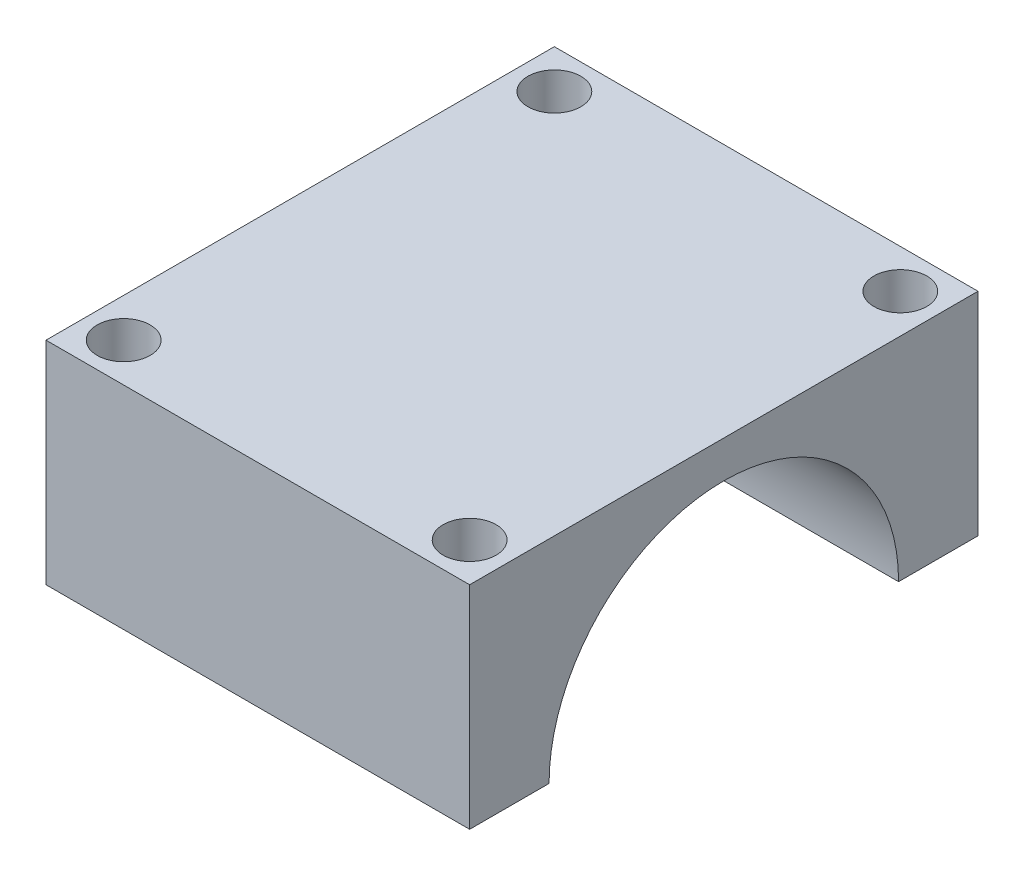
ISO-10303-21;
HEADER;
FILE_DESCRIPTION(('STEP AP214'),'2;1');
FILE_NAME('part.step','',(''),(''),'','','');
FILE_SCHEMA(('AUTOMOTIVE_DESIGN { 1 0 10303 214 1 1 1 1 }'));
ENDSEC;
DATA;
#1=APPLICATION_CONTEXT('core data for automotive mechanical design processes');
#2=APPLICATION_PROTOCOL_DEFINITION('international standard','automotive_design',2000,#1);
#3=PRODUCT_CONTEXT('',#1,'mechanical');
#4=PRODUCT('Part','Part','',(#3));
#5=PRODUCT_RELATED_PRODUCT_CATEGORY('part','',(#4));
#6=PRODUCT_DEFINITION_FORMATION('','',#4);
#7=PRODUCT_DEFINITION_CONTEXT('part definition',#1,'design');
#8=PRODUCT_DEFINITION('design','',#6,#7);
#9=PRODUCT_DEFINITION_SHAPE('','',#8);
#10=(LENGTH_UNIT() NAMED_UNIT(*) SI_UNIT(.MILLI.,.METRE.));
#11=(NAMED_UNIT(*) PLANE_ANGLE_UNIT() SI_UNIT($,.RADIAN.));
#12=(NAMED_UNIT(*) SI_UNIT($,.STERADIAN.) SOLID_ANGLE_UNIT());
#13=UNCERTAINTY_MEASURE_WITH_UNIT(LENGTH_MEASURE(1.E-05),#10,'distance_accuracy_value','');
#14=(GEOMETRIC_REPRESENTATION_CONTEXT(3) GLOBAL_UNCERTAINTY_ASSIGNED_CONTEXT((#13)) GLOBAL_UNIT_ASSIGNED_CONTEXT((#10,
#11,#12)) REPRESENTATION_CONTEXT('',''));
#15=CARTESIAN_POINT('',(0.,0.,0.));
#16=DIRECTION('',(0.,0.,1.));
#17=DIRECTION('',(1.,0.,0.));
#18=AXIS2_PLACEMENT_3D('',#15,#16,#17);
#19=CARTESIAN_POINT('',(15.,30.,18.));
#20=DIRECTION('',(-1.,0.,0.));
#21=DIRECTION('',(0.,0.,1.));
#22=AXIS2_PLACEMENT_3D('',#19,#20,#21);
#23=PLANE('',#22);
#24=DIRECTION('',(0.,-1.,0.));
#25=VECTOR('',#24,1.);
#26=CARTESIAN_POINT('',(15.,30.,18.));
#27=LINE('',#26,#25);
#28=CARTESIAN_POINT('',(15.,30.,18.));
#29=VERTEX_POINT('',#28);
#30=CARTESIAN_POINT('',(15.,15.,18.));
#31=VERTEX_POINT('',#30);
#32=EDGE_CURVE('E124',#29,#31,#27,.T.);
#33=ORIENTED_EDGE('',*,*,#32,.T.);
#34=DIRECTION('',(0.,0.,1.));
#35=VECTOR('',#34,1.);
#36=CARTESIAN_POINT('',(15.,15.,18.));
#37=LINE('',#36,#35);
#38=CARTESIAN_POINT('',(15.,15.,12.375));
#39=VERTEX_POINT('',#38);
#40=EDGE_CURVE('E102',#39,#31,#37,.T.);
#41=ORIENTED_EDGE('',*,*,#40,.F.);
#42=CARTESIAN_POINT('',(15.,15.,0.));
#43=DIRECTION('',(1.,0.,0.));
#44=DIRECTION('',(0.,0.,-1.));
#45=AXIS2_PLACEMENT_3D('',#42,#43,#44);
#46=CIRCLE('',#45,12.375);
#47=CARTESIAN_POINT('',(15.,15.,-12.375));
#48=VERTEX_POINT('',#47);
#49=EDGE_CURVE('E130',#48,#39,#46,.T.);
#50=ORIENTED_EDGE('',*,*,#49,.F.);
#51=CARTESIAN_POINT('',(15.,15.,-18.));
#52=VERTEX_POINT('',#51);
#53=EDGE_CURVE('E71',#52,#48,#37,.T.);
#54=ORIENTED_EDGE('',*,*,#53,.F.);
#55=DIRECTION('',(0.,-1.,0.));
#56=VECTOR('',#55,1.);
#57=CARTESIAN_POINT('',(15.,30.,-18.));
#58=LINE('',#57,#56);
#59=CARTESIAN_POINT('',(15.,30.,-18.));
#60=VERTEX_POINT('',#59);
#61=EDGE_CURVE('E11',#60,#52,#58,.T.);
#62=ORIENTED_EDGE('',*,*,#61,.F.);
#63=DIRECTION('',(0.,0.,-1.));
#64=VECTOR('',#63,1.);
#65=CARTESIAN_POINT('',(15.,30.,18.));
#66=LINE('',#65,#64);
#67=EDGE_CURVE('E129',#29,#60,#66,.T.);
#68=ORIENTED_EDGE('',*,*,#67,.F.);
#69=EDGE_LOOP('',(#33,#41,#50,#54,#62,#68));
#70=FACE_BOUND('',#69,.T.);
#71=ADVANCED_FACE('F47',(#70),#23,.F.);
#72=CARTESIAN_POINT('',(-15.,30.,-18.));
#73=DIRECTION('',(0.,0.,1.));
#74=DIRECTION('',(1.,0.,0.));
#75=AXIS2_PLACEMENT_3D('',#72,#73,#74);
#76=PLANE('',#75);
#77=ORIENTED_EDGE('',*,*,#61,.T.);
#78=DIRECTION('',(1.,0.,0.));
#79=VECTOR('',#78,1.);
#80=CARTESIAN_POINT('',(-15.,15.,-18.));
#81=LINE('',#80,#79);
#82=CARTESIAN_POINT('',(-15.,15.,-18.));
#83=VERTEX_POINT('',#82);
#84=EDGE_CURVE('E107',#83,#52,#81,.T.);
#85=ORIENTED_EDGE('',*,*,#84,.F.);
#86=DIRECTION('',(0.,-1.,0.));
#87=VECTOR('',#86,1.);
#88=CARTESIAN_POINT('',(-15.,30.,-18.));
#89=LINE('',#88,#87);
#90=CARTESIAN_POINT('',(-15.,30.,-18.));
#91=VERTEX_POINT('',#90);
#92=EDGE_CURVE('E55',#91,#83,#89,.T.);
#93=ORIENTED_EDGE('',*,*,#92,.F.);
#94=DIRECTION('',(-1.,0.,0.));
#95=VECTOR('',#94,1.);
#96=CARTESIAN_POINT('',(-15.,30.,-18.));
#97=LINE('',#96,#95);
#98=EDGE_CURVE('E132',#60,#91,#97,.T.);
#99=ORIENTED_EDGE('',*,*,#98,.F.);
#100=EDGE_LOOP('',(#77,#85,#93,#99));
#101=FACE_BOUND('',#100,.T.);
#102=ADVANCED_FACE('F153',(#101),#76,.F.);
#103=CARTESIAN_POINT('',(-15.,30.,18.));
#104=DIRECTION('',(1.,0.,0.));
#105=DIRECTION('',(0.,0.,-1.));
#106=AXIS2_PLACEMENT_3D('',#103,#104,#105);
#107=PLANE('',#106);
#108=ORIENTED_EDGE('',*,*,#92,.T.);
#109=DIRECTION('',(0.,0.,1.));
#110=VECTOR('',#109,1.);
#111=CARTESIAN_POINT('',(-15.,15.,18.));
#112=LINE('',#111,#110);
#113=CARTESIAN_POINT('',(-15.,15.,-12.375));
#114=VERTEX_POINT('',#113);
#115=EDGE_CURVE('E108',#83,#114,#112,.T.);
#116=ORIENTED_EDGE('',*,*,#115,.T.);
#117=CARTESIAN_POINT('',(-15.,15.,0.));
#118=DIRECTION('',(1.,0.,0.));
#119=DIRECTION('',(0.,0.,-1.));
#120=AXIS2_PLACEMENT_3D('',#117,#118,#119);
#121=CIRCLE('',#120,12.375);
#122=CARTESIAN_POINT('',(-15.,15.,12.375));
#123=VERTEX_POINT('',#122);
#124=EDGE_CURVE('E120',#114,#123,#121,.T.);
#125=ORIENTED_EDGE('',*,*,#124,.T.);
#126=CARTESIAN_POINT('',(-15.,15.,18.));
#127=VERTEX_POINT('',#126);
#128=EDGE_CURVE('E63',#123,#127,#112,.T.);
#129=ORIENTED_EDGE('',*,*,#128,.T.);
#130=DIRECTION('',(0.,-1.,0.));
#131=VECTOR('',#130,1.);
#132=CARTESIAN_POINT('',(-15.,30.,18.));
#133=LINE('',#132,#131);
#134=CARTESIAN_POINT('',(-15.,30.,18.));
#135=VERTEX_POINT('',#134);
#136=EDGE_CURVE('E116',#135,#127,#133,.T.);
#137=ORIENTED_EDGE('',*,*,#136,.F.);
#138=DIRECTION('',(0.,0.,1.));
#139=VECTOR('',#138,1.);
#140=CARTESIAN_POINT('',(-15.,30.,18.));
#141=LINE('',#140,#139);
#142=EDGE_CURVE('E145',#91,#135,#141,.T.);
#143=ORIENTED_EDGE('',*,*,#142,.F.);
#144=EDGE_LOOP('',(#108,#116,#125,#129,#137,#143));
#145=FACE_BOUND('',#144,.T.);
#146=ADVANCED_FACE('F114',(#145),#107,.F.);
#147=CARTESIAN_POINT('',(-15.,30.,18.));
#148=DIRECTION('',(0.,0.,-1.));
#149=DIRECTION('',(-1.,0.,0.));
#150=AXIS2_PLACEMENT_3D('',#147,#148,#149);
#151=PLANE('',#150);
#152=ORIENTED_EDGE('',*,*,#136,.T.);
#153=DIRECTION('',(1.,0.,0.));
#154=VECTOR('',#153,1.);
#155=CARTESIAN_POINT('',(-15.,15.,18.));
#156=LINE('',#155,#154);
#157=EDGE_CURVE('E99',#127,#31,#156,.T.);
#158=ORIENTED_EDGE('',*,*,#157,.T.);
#159=ORIENTED_EDGE('',*,*,#32,.F.);
#160=DIRECTION('',(1.,0.,0.));
#161=VECTOR('',#160,1.);
#162=CARTESIAN_POINT('',(-15.,30.,18.));
#163=LINE('',#162,#161);
#164=EDGE_CURVE('E123',#135,#29,#163,.T.);
#165=ORIENTED_EDGE('',*,*,#164,.F.);
#166=EDGE_LOOP('',(#152,#158,#159,#165));
#167=FACE_BOUND('',#166,.T.);
#168=ADVANCED_FACE('F122',(#167),#151,.F.);
#169=CARTESIAN_POINT('',(0.,30.,0.));
#170=DIRECTION('',(0.,-1.,0.));
#171=DIRECTION('',(0.,0.,-1.));
#172=AXIS2_PLACEMENT_3D('',#169,#170,#171);
#173=PLANE('',#172);
#174=CARTESIAN_POINT('',(12.25,30.,-15.25));
#175=DIRECTION('',(0.,1.,0.));
#176=DIRECTION('',(0.,0.,-1.));
#177=AXIS2_PLACEMENT_3D('',#174,#175,#176);
#178=CIRCLE('',#177,1.875);
#179=CARTESIAN_POINT('',(12.25,30.,-17.125));
#180=VERTEX_POINT('',#179);
#181=EDGE_CURVE('E158',#180,#180,#178,.T.);
#182=ORIENTED_EDGE('',*,*,#181,.F.);
#183=EDGE_LOOP('',(#182));
#184=FACE_BOUND('',#183,.T.);
#185=CARTESIAN_POINT('',(12.25,30.,15.25));
#186=DIRECTION('',(0.,1.,0.));
#187=DIRECTION('',(0.,0.,1.));
#188=AXIS2_PLACEMENT_3D('',#185,#186,#187);
#189=CIRCLE('',#188,1.875);
#190=CARTESIAN_POINT('',(12.25,30.,17.125));
#191=VERTEX_POINT('',#190);
#192=EDGE_CURVE('E161',#191,#191,#189,.T.);
#193=ORIENTED_EDGE('',*,*,#192,.F.);
#194=EDGE_LOOP('',(#193));
#195=FACE_BOUND('',#194,.T.);
#196=CARTESIAN_POINT('',(-12.25,30.,15.25));
#197=DIRECTION('',(0.,1.,0.));
#198=DIRECTION('',(0.,0.,-1.));
#199=AXIS2_PLACEMENT_3D('',#196,#197,#198);
#200=CIRCLE('',#199,1.875);
#201=CARTESIAN_POINT('',(-12.25,30.,13.375));
#202=VERTEX_POINT('',#201);
#203=EDGE_CURVE('E140',#202,#202,#200,.T.);
#204=ORIENTED_EDGE('',*,*,#203,.F.);
#205=EDGE_LOOP('',(#204));
#206=FACE_BOUND('',#205,.T.);
#207=CARTESIAN_POINT('',(-12.25,30.,-15.25));
#208=DIRECTION('',(0.,1.,0.));
#209=DIRECTION('',(0.,0.,1.));
#210=AXIS2_PLACEMENT_3D('',#207,#208,#209);
#211=CIRCLE('',#210,1.875);
#212=CARTESIAN_POINT('',(-12.25,30.,-13.375));
#213=VERTEX_POINT('',#212);
#214=EDGE_CURVE('E135',#213,#213,#211,.T.);
#215=ORIENTED_EDGE('',*,*,#214,.F.);
#216=EDGE_LOOP('',(#215));
#217=FACE_BOUND('',#216,.T.);
#218=ORIENTED_EDGE('',*,*,#67,.T.);
#219=ORIENTED_EDGE('',*,*,#98,.T.);
#220=ORIENTED_EDGE('',*,*,#142,.T.);
#221=ORIENTED_EDGE('',*,*,#164,.T.);
#222=EDGE_LOOP('',(#218,#219,#220,#221));
#223=FACE_BOUND('',#222,.T.);
#224=ADVANCED_FACE('F147',(#184,#195,#206,#217,#223),#173,.F.);
#225=CARTESIAN_POINT('',(-25.,15.,0.));
#226=DIRECTION('',(1.,0.,0.));
#227=DIRECTION('',(0.,0.,-1.));
#228=AXIS2_PLACEMENT_3D('',#225,#226,#227);
#229=CYLINDRICAL_SURFACE('',#228,12.375);
#230=ORIENTED_EDGE('',*,*,#49,.T.);
#231=DIRECTION('',(1.,0.,0.));
#232=VECTOR('',#231,1.);
#233=CARTESIAN_POINT('',(-25.,15.,12.375));
#234=LINE('',#233,#232);
#235=EDGE_CURVE('E157',#39,#123,#234,.F.);
#236=ORIENTED_EDGE('',*,*,#235,.T.);
#237=ORIENTED_EDGE('',*,*,#124,.F.);
#238=DIRECTION('',(1.,0.,0.));
#239=VECTOR('',#238,1.);
#240=CARTESIAN_POINT('',(-25.,15.,-12.375));
#241=LINE('',#240,#239);
#242=EDGE_CURVE('E156',#114,#48,#241,.T.);
#243=ORIENTED_EDGE('',*,*,#242,.T.);
#244=EDGE_LOOP('',(#230,#236,#237,#243));
#245=FACE_BOUND('',#244,.T.);
#246=ADVANCED_FACE('F155',(#245),#229,.F.);
#247=CARTESIAN_POINT('',(-12.25,-10.,-15.25));
#248=DIRECTION('',(0.,1.,0.));
#249=DIRECTION('',(0.,0.,1.));
#250=AXIS2_PLACEMENT_3D('',#247,#248,#249);
#251=CYLINDRICAL_SURFACE('',#250,1.875);
#252=CARTESIAN_POINT('',(-12.25,15.,-15.25));
#253=DIRECTION('',(0.,1.,0.));
#254=DIRECTION('',(0.,0.,1.));
#255=AXIS2_PLACEMENT_3D('',#252,#253,#254);
#256=CIRCLE('',#255,1.875);
#257=CARTESIAN_POINT('',(-12.25,15.,-13.375));
#258=VERTEX_POINT('',#257);
#259=EDGE_CURVE('E162',#258,#258,#256,.F.);
#260=ORIENTED_EDGE('',*,*,#259,.T.);
#261=EDGE_LOOP('',(#260));
#262=FACE_BOUND('',#261,.T.);
#263=ORIENTED_EDGE('',*,*,#214,.T.);
#264=EDGE_LOOP('',(#263));
#265=FACE_BOUND('',#264,.T.);
#266=ADVANCED_FACE('F181',(#262,#265),#251,.F.);
#267=CARTESIAN_POINT('',(-12.25,-10.,15.25));
#268=DIRECTION('',(0.,1.,0.));
#269=DIRECTION('',(0.,0.,1.));
#270=AXIS2_PLACEMENT_3D('',#267,#268,#269);
#271=CYLINDRICAL_SURFACE('',#270,1.875);
#272=CARTESIAN_POINT('',(-12.25,15.,15.25));
#273=DIRECTION('',(0.,1.,0.));
#274=DIRECTION('',(0.,0.,1.));
#275=AXIS2_PLACEMENT_3D('',#272,#273,#274);
#276=CIRCLE('',#275,1.875);
#277=CARTESIAN_POINT('',(-12.25,15.,17.125));
#278=VERTEX_POINT('',#277);
#279=EDGE_CURVE('E301',#278,#278,#276,.F.);
#280=ORIENTED_EDGE('',*,*,#279,.T.);
#281=EDGE_LOOP('',(#280));
#282=FACE_BOUND('',#281,.T.);
#283=ORIENTED_EDGE('',*,*,#203,.T.);
#284=EDGE_LOOP('',(#283));
#285=FACE_BOUND('',#284,.T.);
#286=ADVANCED_FACE('F183',(#282,#285),#271,.F.);
#287=CARTESIAN_POINT('',(12.25,-10.,15.25));
#288=DIRECTION('',(0.,1.,0.));
#289=DIRECTION('',(0.,0.,1.));
#290=AXIS2_PLACEMENT_3D('',#287,#288,#289);
#291=CYLINDRICAL_SURFACE('',#290,1.875);
#292=CARTESIAN_POINT('',(12.25,15.,15.25));
#293=DIRECTION('',(0.,1.,0.));
#294=DIRECTION('',(0.,0.,1.));
#295=AXIS2_PLACEMENT_3D('',#292,#293,#294);
#296=CIRCLE('',#295,1.875);
#297=CARTESIAN_POINT('',(12.25,15.,17.125));
#298=VERTEX_POINT('',#297);
#299=EDGE_CURVE('E304',#298,#298,#296,.F.);
#300=ORIENTED_EDGE('',*,*,#299,.T.);
#301=EDGE_LOOP('',(#300));
#302=FACE_BOUND('',#301,.T.);
#303=ORIENTED_EDGE('',*,*,#192,.T.);
#304=EDGE_LOOP('',(#303));
#305=FACE_BOUND('',#304,.T.);
#306=ADVANCED_FACE('F171',(#302,#305),#291,.F.);
#307=CARTESIAN_POINT('',(12.25,-10.,-15.25));
#308=DIRECTION('',(0.,1.,0.));
#309=DIRECTION('',(0.,0.,1.));
#310=AXIS2_PLACEMENT_3D('',#307,#308,#309);
#311=CYLINDRICAL_SURFACE('',#310,1.875);
#312=CARTESIAN_POINT('',(12.25,15.,-15.25));
#313=DIRECTION('',(0.,1.,0.));
#314=DIRECTION('',(0.,0.,1.));
#315=AXIS2_PLACEMENT_3D('',#312,#313,#314);
#316=CIRCLE('',#315,1.875);
#317=CARTESIAN_POINT('',(12.25,15.,-13.375));
#318=VERTEX_POINT('',#317);
#319=EDGE_CURVE('E50',#318,#318,#316,.F.);
#320=ORIENTED_EDGE('',*,*,#319,.T.);
#321=EDGE_LOOP('',(#320));
#322=FACE_BOUND('',#321,.T.);
#323=ORIENTED_EDGE('',*,*,#181,.T.);
#324=EDGE_LOOP('',(#323));
#325=FACE_BOUND('',#324,.T.);
#326=ADVANCED_FACE('F268',(#322,#325),#311,.F.);
#327=CARTESIAN_POINT('',(-15.,15.,18.));
#328=DIRECTION('',(0.,1.,0.));
#329=DIRECTION('',(0.,0.,1.));
#330=AXIS2_PLACEMENT_3D('',#327,#328,#329);
#331=PLANE('',#330);
#332=ORIENTED_EDGE('',*,*,#259,.F.);
#333=EDGE_LOOP('',(#332));
#334=FACE_BOUND('',#333,.T.);
#335=ORIENTED_EDGE('',*,*,#319,.F.);
#336=EDGE_LOOP('',(#335));
#337=FACE_BOUND('',#336,.T.);
#338=ORIENTED_EDGE('',*,*,#115,.F.);
#339=ORIENTED_EDGE('',*,*,#84,.T.);
#340=ORIENTED_EDGE('',*,*,#53,.T.);
#341=ORIENTED_EDGE('',*,*,#242,.F.);
#342=EDGE_LOOP('',(#338,#339,#340,#341));
#343=FACE_BOUND('',#342,.T.);
#344=ADVANCED_FACE('F278',(#334,#337,#343),#331,.F.);
#345=ORIENTED_EDGE('',*,*,#279,.F.);
#346=EDGE_LOOP('',(#345));
#347=FACE_BOUND('',#346,.T.);
#348=ORIENTED_EDGE('',*,*,#299,.F.);
#349=EDGE_LOOP('',(#348));
#350=FACE_BOUND('',#349,.T.);
#351=ORIENTED_EDGE('',*,*,#40,.T.);
#352=ORIENTED_EDGE('',*,*,#157,.F.);
#353=ORIENTED_EDGE('',*,*,#128,.F.);
#354=ORIENTED_EDGE('',*,*,#235,.F.);
#355=EDGE_LOOP('',(#351,#352,#353,#354));
#356=FACE_BOUND('',#355,.T.);
#357=ADVANCED_FACE('F100',(#347,#350,#356),#331,.F.);
#358=CLOSED_SHELL('',(#71,#102,#146,#168,#224,#246,#266,#286,#306,#326,#344,#357));
#359=MANIFOLD_SOLID_BREP('B2',#358);
#360=ADVANCED_BREP_SHAPE_REPRESENTATION('',(#18,#359),#14);
#361=SHAPE_DEFINITION_REPRESENTATION(#9,#360);
ENDSEC;
END-ISO-10303-21;
